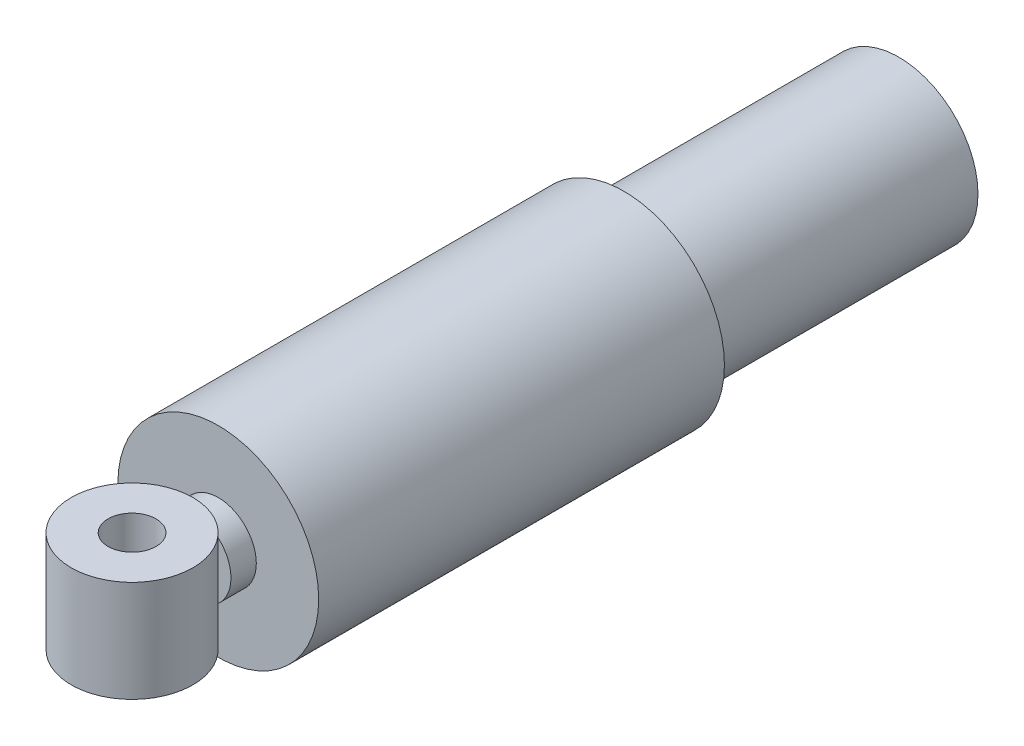
ISO-10303-21;
HEADER;
FILE_DESCRIPTION(('STEP AP214'),'2;1');
FILE_NAME('part.step','',(''),(''),'','','');
FILE_SCHEMA(('AUTOMOTIVE_DESIGN { 1 0 10303 214 1 1 1 1 }'));
ENDSEC;
DATA;
#1=APPLICATION_CONTEXT('core data for automotive mechanical design processes');
#2=APPLICATION_PROTOCOL_DEFINITION('international standard','automotive_design',2000,#1);
#3=PRODUCT_CONTEXT('',#1,'mechanical');
#4=PRODUCT('Part','Part','',(#3));
#5=PRODUCT_RELATED_PRODUCT_CATEGORY('part','',(#4));
#6=PRODUCT_DEFINITION_FORMATION('','',#4);
#7=PRODUCT_DEFINITION_CONTEXT('part definition',#1,'design');
#8=PRODUCT_DEFINITION('design','',#6,#7);
#9=PRODUCT_DEFINITION_SHAPE('','',#8);
#10=(LENGTH_UNIT() NAMED_UNIT(*) SI_UNIT(.MILLI.,.METRE.));
#11=(NAMED_UNIT(*) PLANE_ANGLE_UNIT() SI_UNIT($,.RADIAN.));
#12=(NAMED_UNIT(*) SI_UNIT($,.STERADIAN.) SOLID_ANGLE_UNIT());
#13=UNCERTAINTY_MEASURE_WITH_UNIT(LENGTH_MEASURE(1.E-05),#10,'distance_accuracy_value','');
#14=(GEOMETRIC_REPRESENTATION_CONTEXT(3) GLOBAL_UNCERTAINTY_ASSIGNED_CONTEXT((#13)) GLOBAL_UNIT_ASSIGNED_CONTEXT((#10,
#11,#12)) REPRESENTATION_CONTEXT('',''));
#15=CARTESIAN_POINT('',(0.,0.,0.));
#16=DIRECTION('',(0.,0.,1.));
#17=DIRECTION('',(1.,0.,0.));
#18=AXIS2_PLACEMENT_3D('',#15,#16,#17);
#19=CARTESIAN_POINT('',(0.,12.7,192.024));
#20=DIRECTION('',(0.,-1.,0.));
#21=DIRECTION('',(0.,0.,-1.));
#22=AXIS2_PLACEMENT_3D('',#19,#20,#21);
#23=CYLINDRICAL_SURFACE('',#22,15.24);
#24=CARTESIAN_POINT('',(0.,12.7,192.024));
#25=DIRECTION('',(0.,1.,0.));
#26=DIRECTION('',(0.,0.,1.));
#27=AXIS2_PLACEMENT_3D('',#24,#25,#26);
#28=CIRCLE('',#27,15.24);
#29=CARTESIAN_POINT('',(0.,12.7,207.264));
#30=VERTEX_POINT('',#29);
#31=EDGE_CURVE('E11',#30,#30,#28,.T.);
#32=ORIENTED_EDGE('',*,*,#31,.F.);
#33=EDGE_LOOP('',(#32));
#34=FACE_BOUND('',#33,.T.);
#35=CARTESIAN_POINT('',(0.,-12.7,192.024));
#36=DIRECTION('',(0.,-1.,0.));
#37=DIRECTION('',(0.,0.,-1.));
#38=AXIS2_PLACEMENT_3D('',#35,#36,#37);
#39=CIRCLE('',#38,15.24);
#40=CARTESIAN_POINT('',(0.,-12.7,176.784));
#41=VERTEX_POINT('',#40);
#42=EDGE_CURVE('E53',#41,#41,#39,.T.);
#43=ORIENTED_EDGE('',*,*,#42,.F.);
#44=EDGE_LOOP('',(#43));
#45=FACE_BOUND('',#44,.T.);
#46=ADVANCED_FACE('F46',(#34,#45),#23,.T.);
#47=CARTESIAN_POINT('',(0.,12.7,0.));
#48=DIRECTION('',(0.,1.,0.));
#49=DIRECTION('',(0.,0.,1.));
#50=AXIS2_PLACEMENT_3D('',#47,#48,#49);
#51=PLANE('',#50);
#52=CARTESIAN_POINT('',(0.,12.7,192.024));
#53=DIRECTION('',(0.,1.,0.));
#54=DIRECTION('',(0.,0.,1.));
#55=AXIS2_PLACEMENT_3D('',#52,#53,#54);
#56=CIRCLE('',#55,6.00074999999998);
#57=CARTESIAN_POINT('',(0.,12.7,198.02475));
#58=VERTEX_POINT('',#57);
#59=EDGE_CURVE('E59',#58,#58,#56,.T.);
#60=ORIENTED_EDGE('',*,*,#59,.F.);
#61=EDGE_LOOP('',(#60));
#62=FACE_BOUND('',#61,.T.);
#63=ORIENTED_EDGE('',*,*,#31,.T.);
#64=EDGE_LOOP('',(#63));
#65=FACE_BOUND('',#64,.T.);
#66=ADVANCED_FACE('F71',(#62,#65),#51,.T.);
#67=CARTESIAN_POINT('',(0.,-12.7,192.024));
#68=DIRECTION('',(0.,-1.,0.));
#69=DIRECTION('',(0.,0.,-1.));
#70=AXIS2_PLACEMENT_3D('',#67,#68,#69);
#71=PLANE('',#70);
#72=CARTESIAN_POINT('',(0.,-12.7,192.024));
#73=DIRECTION('',(0.,-1.,0.));
#74=DIRECTION('',(0.,0.,-1.));
#75=AXIS2_PLACEMENT_3D('',#72,#73,#74);
#76=CIRCLE('',#75,6.00074999999998);
#77=CARTESIAN_POINT('',(0.,-12.7,186.02325));
#78=VERTEX_POINT('',#77);
#79=EDGE_CURVE('E49',#78,#78,#76,.T.);
#80=ORIENTED_EDGE('',*,*,#79,.F.);
#81=EDGE_LOOP('',(#80));
#82=FACE_BOUND('',#81,.T.);
#83=ORIENTED_EDGE('',*,*,#42,.T.);
#84=EDGE_LOOP('',(#83));
#85=FACE_BOUND('',#84,.T.);
#86=ADVANCED_FACE('F68',(#82,#85),#71,.T.);
#87=CARTESIAN_POINT('',(0.,-25.146,192.024));
#88=DIRECTION('',(0.,1.,0.));
#89=DIRECTION('',(0.,0.,1.));
#90=AXIS2_PLACEMENT_3D('',#87,#88,#89);
#91=CYLINDRICAL_SURFACE('',#90,6.00074999999998);
#92=ORIENTED_EDGE('',*,*,#79,.T.);
#93=EDGE_LOOP('',(#92));
#94=FACE_BOUND('',#93,.T.);
#95=ORIENTED_EDGE('',*,*,#59,.T.);
#96=EDGE_LOOP('',(#95));
#97=FACE_BOUND('',#96,.T.);
#98=ADVANCED_FACE('F66',(#94,#97),#91,.F.);
#99=CLOSED_SHELL('',(#46,#66,#86,#98));
#100=MANIFOLD_SOLID_BREP('B2',#99);
#101=CARTESIAN_POINT('',(0.,0.,68.834));
#102=DIRECTION('',(0.,0.,-1.));
#103=DIRECTION('',(-1.,0.,0.));
#104=AXIS2_PLACEMENT_3D('',#101,#102,#103);
#105=CYLINDRICAL_SURFACE('',#104,19.812);
#106=CARTESIAN_POINT('',(0.,0.,68.834));
#107=DIRECTION('',(0.,0.,1.));
#108=DIRECTION('',(1.,0.,0.));
#109=AXIS2_PLACEMENT_3D('',#106,#107,#108);
#110=CIRCLE('',#109,19.812);
#111=CARTESIAN_POINT('',(19.812,0.,68.834));
#112=VERTEX_POINT('',#111);
#113=EDGE_CURVE('E125',#112,#112,#110,.T.);
#114=ORIENTED_EDGE('',*,*,#113,.F.);
#115=EDGE_LOOP('',(#114));
#116=FACE_BOUND('',#115,.T.);
#117=CARTESIAN_POINT('',(0.,0.,0.));
#118=DIRECTION('',(0.,0.,1.));
#119=DIRECTION('',(1.,0.,0.));
#120=AXIS2_PLACEMENT_3D('',#117,#118,#119);
#121=CIRCLE('',#120,19.812);
#122=CARTESIAN_POINT('',(19.812,0.,0.));
#123=VERTEX_POINT('',#122);
#124=EDGE_CURVE('E121',#123,#123,#121,.T.);
#125=ORIENTED_EDGE('',*,*,#124,.T.);
#126=EDGE_LOOP('',(#125));
#127=FACE_BOUND('',#126,.T.);
#128=ADVANCED_FACE('F118',(#116,#127),#105,.T.);
#129=CARTESIAN_POINT('',(0.,0.,0.));
#130=DIRECTION('',(0.,0.,1.));
#131=DIRECTION('',(1.,0.,0.));
#132=AXIS2_PLACEMENT_3D('',#129,#130,#131);
#133=PLANE('',#132);
#134=ORIENTED_EDGE('',*,*,#124,.F.);
#135=EDGE_LOOP('',(#134));
#136=FACE_BOUND('',#135,.T.);
#137=ADVANCED_FACE('F159',(#136),#133,.F.);
#138=CARTESIAN_POINT('',(0.,0.,170.434));
#139=DIRECTION('',(0.,0.,-1.));
#140=DIRECTION('',(-1.,0.,0.));
#141=AXIS2_PLACEMENT_3D('',#138,#139,#140);
#142=CYLINDRICAL_SURFACE('',#141,25.146);
#143=CARTESIAN_POINT('',(0.,0.,170.434));
#144=DIRECTION('',(0.,0.,1.));
#145=DIRECTION('',(1.,0.,0.));
#146=AXIS2_PLACEMENT_3D('',#143,#144,#145);
#147=CIRCLE('',#146,25.146);
#148=CARTESIAN_POINT('',(25.146,0.,170.434));
#149=VERTEX_POINT('',#148);
#150=EDGE_CURVE('E133',#149,#149,#147,.T.);
#151=ORIENTED_EDGE('',*,*,#150,.F.);
#152=EDGE_LOOP('',(#151));
#153=FACE_BOUND('',#152,.T.);
#154=CARTESIAN_POINT('',(0.,0.,68.834));
#155=DIRECTION('',(0.,0.,1.));
#156=DIRECTION('',(1.,0.,0.));
#157=AXIS2_PLACEMENT_3D('',#154,#155,#156);
#158=CIRCLE('',#157,25.146);
#159=CARTESIAN_POINT('',(25.146,0.,68.834));
#160=VERTEX_POINT('',#159);
#161=EDGE_CURVE('E136',#160,#160,#158,.T.);
#162=ORIENTED_EDGE('',*,*,#161,.T.);
#163=EDGE_LOOP('',(#162));
#164=FACE_BOUND('',#163,.T.);
#165=ADVANCED_FACE('F164',(#153,#164),#142,.T.);
#166=CARTESIAN_POINT('',(0.,0.,170.434));
#167=DIRECTION('',(0.,0.,1.));
#168=DIRECTION('',(1.,0.,0.));
#169=AXIS2_PLACEMENT_3D('',#166,#167,#168);
#170=PLANE('',#169);
#171=CARTESIAN_POINT('',(0.,0.,170.434));
#172=DIRECTION('',(0.,0.,1.));
#173=DIRECTION('',(1.,0.,0.));
#174=AXIS2_PLACEMENT_3D('',#171,#172,#173);
#175=CIRCLE('',#174,9.525);
#176=CARTESIAN_POINT('',(9.525,0.,170.434));
#177=VERTEX_POINT('',#176);
#178=EDGE_CURVE('E45',#177,#177,#175,.T.);
#179=ORIENTED_EDGE('',*,*,#178,.F.);
#180=EDGE_LOOP('',(#179));
#181=FACE_BOUND('',#180,.T.);
#182=ORIENTED_EDGE('',*,*,#150,.T.);
#183=EDGE_LOOP('',(#182));
#184=FACE_BOUND('',#183,.T.);
#185=ADVANCED_FACE('F154',(#181,#184),#170,.T.);
#186=CARTESIAN_POINT('',(0.,0.,68.834));
#187=DIRECTION('',(0.,0.,1.));
#188=DIRECTION('',(1.,0.,0.));
#189=AXIS2_PLACEMENT_3D('',#186,#187,#188);
#190=PLANE('',#189);
#191=ORIENTED_EDGE('',*,*,#113,.T.);
#192=EDGE_LOOP('',(#191));
#193=FACE_BOUND('',#192,.T.);
#194=ORIENTED_EDGE('',*,*,#161,.F.);
#195=EDGE_LOOP('',(#194));
#196=FACE_BOUND('',#195,.T.);
#197=ADVANCED_FACE('F147',(#193,#196),#190,.F.);
#198=CARTESIAN_POINT('',(0.,0.,176.784));
#199=DIRECTION('',(0.,0.,-1.));
#200=DIRECTION('',(-1.,0.,0.));
#201=AXIS2_PLACEMENT_3D('',#198,#199,#200);
#202=CYLINDRICAL_SURFACE('',#201,9.525);
#203=CARTESIAN_POINT('',(0.,0.,176.784));
#204=DIRECTION('',(0.,0.,1.));
#205=DIRECTION('',(1.,0.,0.));
#206=AXIS2_PLACEMENT_3D('',#203,#204,#205);
#207=CIRCLE('',#206,9.525);
#208=CARTESIAN_POINT('',(9.525,0.,176.784));
#209=VERTEX_POINT('',#208);
#210=EDGE_CURVE('E132',#209,#209,#207,.T.);
#211=ORIENTED_EDGE('',*,*,#210,.F.);
#212=EDGE_LOOP('',(#211));
#213=FACE_BOUND('',#212,.T.);
#214=ORIENTED_EDGE('',*,*,#178,.T.);
#215=EDGE_LOOP('',(#214));
#216=FACE_BOUND('',#215,.T.);
#217=ADVANCED_FACE('F145',(#213,#216),#202,.T.);
#218=CARTESIAN_POINT('',(0.,0.,176.784));
#219=DIRECTION('',(0.,0.,1.));
#220=DIRECTION('',(1.,0.,0.));
#221=AXIS2_PLACEMENT_3D('',#218,#219,#220);
#222=PLANE('',#221);
#223=ORIENTED_EDGE('',*,*,#210,.T.);
#224=EDGE_LOOP('',(#223));
#225=FACE_BOUND('',#224,.T.);
#226=ADVANCED_FACE('F143',(#225),#222,.T.);
#227=CLOSED_SHELL('',(#128,#137,#165,#185,#197,#217,#226));
#228=MANIFOLD_SOLID_BREP('B6',#227);
#229=ADVANCED_BREP_SHAPE_REPRESENTATION('',(#18,#100,#228),#14);
#230=SHAPE_DEFINITION_REPRESENTATION(#9,#229);
ENDSEC;
END-ISO-10303-21;
